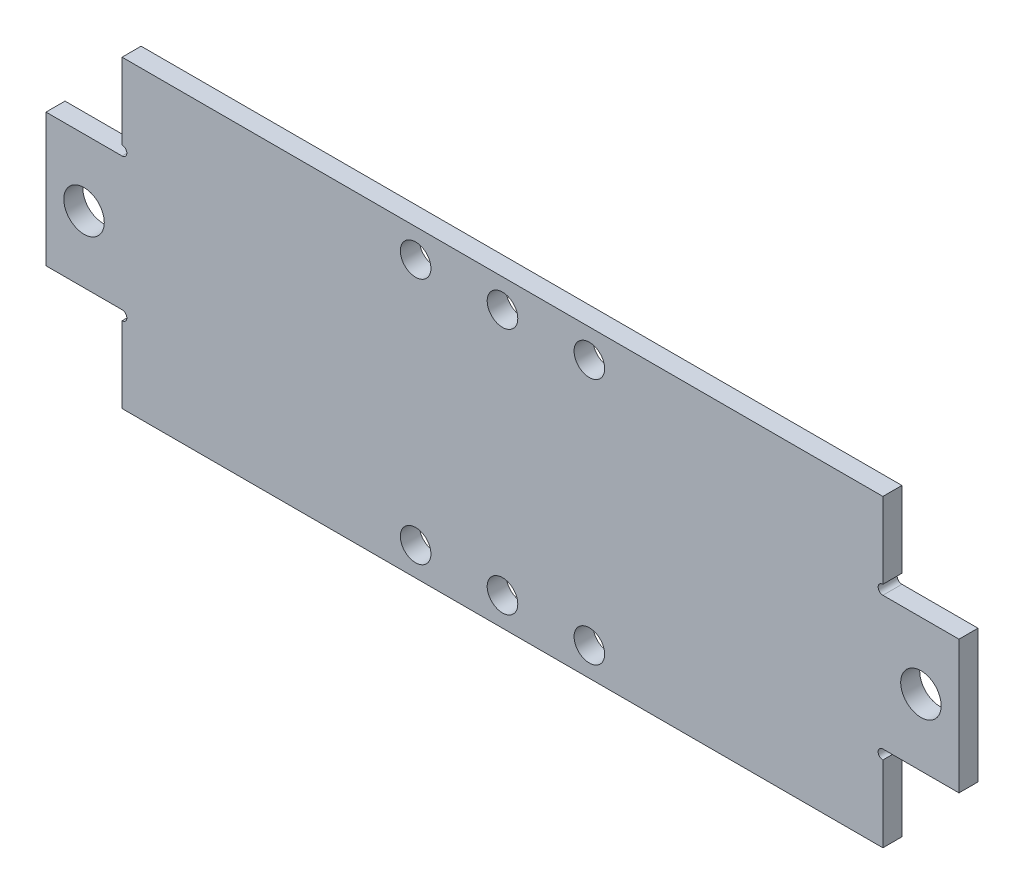
ISO-10303-21;
HEADER;
FILE_DESCRIPTION(('STEP AP214'),'2;1');
FILE_NAME('part.step','',(''),(''),'','','');
FILE_SCHEMA(('AUTOMOTIVE_DESIGN { 1 0 10303 214 1 1 1 1 }'));
ENDSEC;
DATA;
#1=APPLICATION_CONTEXT('core data for automotive mechanical design processes');
#2=APPLICATION_PROTOCOL_DEFINITION('international standard','automotive_design',2000,#1);
#3=PRODUCT_CONTEXT('',#1,'mechanical');
#4=PRODUCT('Part','Part','',(#3));
#5=PRODUCT_RELATED_PRODUCT_CATEGORY('part','',(#4));
#6=PRODUCT_DEFINITION_FORMATION('','',#4);
#7=PRODUCT_DEFINITION_CONTEXT('part definition',#1,'design');
#8=PRODUCT_DEFINITION('design','',#6,#7);
#9=PRODUCT_DEFINITION_SHAPE('','',#8);
#10=(LENGTH_UNIT() NAMED_UNIT(*) SI_UNIT(.MILLI.,.METRE.));
#11=(NAMED_UNIT(*) PLANE_ANGLE_UNIT() SI_UNIT($,.RADIAN.));
#12=(NAMED_UNIT(*) SI_UNIT($,.STERADIAN.) SOLID_ANGLE_UNIT());
#13=UNCERTAINTY_MEASURE_WITH_UNIT(LENGTH_MEASURE(1.E-05),#10,'distance_accuracy_value','');
#14=(GEOMETRIC_REPRESENTATION_CONTEXT(3) GLOBAL_UNCERTAINTY_ASSIGNED_CONTEXT((#13)) GLOBAL_UNIT_ASSIGNED_CONTEXT((#10,
#11,#12)) REPRESENTATION_CONTEXT('',''));
#15=CARTESIAN_POINT('',(0.,0.,0.));
#16=DIRECTION('',(0.,0.,1.));
#17=DIRECTION('',(1.,0.,0.));
#18=AXIS2_PLACEMENT_3D('',#15,#16,#17);
#19=CARTESIAN_POINT('',(0.,0.,3.175));
#20=DIRECTION('',(0.,0.,-1.));
#21=DIRECTION('',(-1.,0.,0.));
#22=AXIS2_PLACEMENT_3D('',#19,#20,#21);
#23=PLANE('',#22);
#24=CARTESIAN_POINT('',(78.,46.0375,3.175));
#25=DIRECTION('',(0.,0.,1.));
#26=DIRECTION('',(1.,0.,0.));
#27=AXIS2_PLACEMENT_3D('',#24,#25,#26);
#28=CIRCLE('',#27,2.55270000000001);
#29=CARTESIAN_POINT('',(80.5527,46.0375,3.175));
#30=VERTEX_POINT('',#29);
#31=EDGE_CURVE('E393',#30,#30,#28,.T.);
#32=ORIENTED_EDGE('',*,*,#31,.F.);
#33=EDGE_LOOP('',(#32));
#34=FACE_BOUND('',#33,.T.);
#35=DIRECTION('',(-1.,0.,0.));
#36=VECTOR('',#35,1.);
#37=CARTESIAN_POINT('',(127.,36.5125,3.175));
#38=LINE('',#37,#36);
#39=CARTESIAN_POINT('',(139.7,36.5125,3.175));
#40=VERTEX_POINT('',#39);
#41=CARTESIAN_POINT('',(127.,36.5125,3.175));
#42=VERTEX_POINT('',#41);
#43=EDGE_CURVE('E174',#40,#42,#38,.T.);
#44=ORIENTED_EDGE('',*,*,#43,.T.);
#45=CARTESIAN_POINT('',(127.,37.30625,3.175));
#46=DIRECTION('',(0.,0.,1.));
#47=DIRECTION('',(1.,0.,0.));
#48=AXIS2_PLACEMENT_3D('',#45,#46,#47);
#49=CIRCLE('',#48,0.793750000000021);
#50=CARTESIAN_POINT('',(127.,38.1,3.175));
#51=VERTEX_POINT('',#50);
#52=EDGE_CURVE('E162',#51,#42,#49,.T.);
#53=ORIENTED_EDGE('',*,*,#52,.F.);
#54=DIRECTION('',(0.,1.,0.));
#55=VECTOR('',#54,1.);
#56=CARTESIAN_POINT('',(127.,0.,3.175));
#57=LINE('',#56,#55);
#58=CARTESIAN_POINT('',(127.,50.8,3.175));
#59=VERTEX_POINT('',#58);
#60=EDGE_CURVE('E171',#51,#59,#57,.T.);
#61=ORIENTED_EDGE('',*,*,#60,.T.);
#62=DIRECTION('',(-1.,0.,0.));
#63=VECTOR('',#62,1.);
#64=CARTESIAN_POINT('',(0.,50.8,3.175));
#65=LINE('',#64,#63);
#66=CARTESIAN_POINT('',(0.,50.8,3.175));
#67=VERTEX_POINT('',#66);
#68=EDGE_CURVE('E54',#59,#67,#65,.T.);
#69=ORIENTED_EDGE('',*,*,#68,.T.);
#70=DIRECTION('',(0.,-1.,0.));
#71=VECTOR('',#70,1.);
#72=CARTESIAN_POINT('',(0.,0.,3.175));
#73=LINE('',#72,#71);
#74=CARTESIAN_POINT('',(0.,38.1,3.175));
#75=VERTEX_POINT('',#74);
#76=EDGE_CURVE('E184',#67,#75,#73,.T.);
#77=ORIENTED_EDGE('',*,*,#76,.T.);
#78=CARTESIAN_POINT('',(0.,37.30625,3.175));
#79=DIRECTION('',(0.,0.,1.));
#80=DIRECTION('',(1.,0.,0.));
#81=AXIS2_PLACEMENT_3D('',#78,#79,#80);
#82=CIRCLE('',#81,0.79375);
#83=CARTESIAN_POINT('',(0.,36.5125,3.175));
#84=VERTEX_POINT('',#83);
#85=EDGE_CURVE('E269',#84,#75,#82,.T.);
#86=ORIENTED_EDGE('',*,*,#85,.F.);
#87=DIRECTION('',(-1.,0.,0.));
#88=VECTOR('',#87,1.);
#89=CARTESIAN_POINT('',(0.,36.5125,3.175));
#90=LINE('',#89,#88);
#91=CARTESIAN_POINT('',(-12.7,36.5125,3.175));
#92=VERTEX_POINT('',#91);
#93=EDGE_CURVE('E210',#84,#92,#90,.T.);
#94=ORIENTED_EDGE('',*,*,#93,.T.);
#95=DIRECTION('',(0.,-1.,0.));
#96=VECTOR('',#95,1.);
#97=CARTESIAN_POINT('',(-12.7,36.5125,3.175));
#98=LINE('',#97,#96);
#99=CARTESIAN_POINT('',(-12.7,14.2875,3.175));
#100=VERTEX_POINT('',#99);
#101=EDGE_CURVE('E219',#92,#100,#98,.T.);
#102=ORIENTED_EDGE('',*,*,#101,.T.);
#103=DIRECTION('',(1.,0.,0.));
#104=VECTOR('',#103,1.);
#105=CARTESIAN_POINT('',(0.,14.2875,3.175));
#106=LINE('',#105,#104);
#107=CARTESIAN_POINT('',(0.,14.2875,3.175));
#108=VERTEX_POINT('',#107);
#109=EDGE_CURVE('E222',#100,#108,#106,.T.);
#110=ORIENTED_EDGE('',*,*,#109,.T.);
#111=CARTESIAN_POINT('',(0.,13.49375,3.175));
#112=DIRECTION('',(0.,0.,1.));
#113=DIRECTION('',(1.,0.,0.));
#114=AXIS2_PLACEMENT_3D('',#111,#112,#113);
#115=CIRCLE('',#114,0.79375);
#116=CARTESIAN_POINT('',(0.,12.7,3.175));
#117=VERTEX_POINT('',#116);
#118=EDGE_CURVE('E282',#117,#108,#115,.T.);
#119=ORIENTED_EDGE('',*,*,#118,.F.);
#120=CARTESIAN_POINT('',(0.,0.,3.175));
#121=VERTEX_POINT('',#120);
#122=EDGE_CURVE('E85',#117,#121,#73,.T.);
#123=ORIENTED_EDGE('',*,*,#122,.T.);
#124=DIRECTION('',(1.,0.,0.));
#125=VECTOR('',#124,1.);
#126=CARTESIAN_POINT('',(0.,0.,3.175));
#127=LINE('',#126,#125);
#128=CARTESIAN_POINT('',(127.,0.,3.175));
#129=VERTEX_POINT('',#128);
#130=EDGE_CURVE('E180',#121,#129,#127,.T.);
#131=ORIENTED_EDGE('',*,*,#130,.T.);
#132=CARTESIAN_POINT('',(127.,12.7,3.175));
#133=VERTEX_POINT('',#132);
#134=EDGE_CURVE('E179',#129,#133,#57,.T.);
#135=ORIENTED_EDGE('',*,*,#134,.T.);
#136=CARTESIAN_POINT('',(127.,13.49375,3.175));
#137=DIRECTION('',(0.,0.,1.));
#138=DIRECTION('',(1.,0.,0.));
#139=AXIS2_PLACEMENT_3D('',#136,#137,#138);
#140=CIRCLE('',#139,0.79375000000002);
#141=CARTESIAN_POINT('',(127.,14.2875,3.175));
#142=VERTEX_POINT('',#141);
#143=EDGE_CURVE('E167',#142,#133,#140,.T.);
#144=ORIENTED_EDGE('',*,*,#143,.F.);
#145=DIRECTION('',(1.,0.,0.));
#146=VECTOR('',#145,1.);
#147=CARTESIAN_POINT('',(127.,14.2875,3.175));
#148=LINE('',#147,#146);
#149=CARTESIAN_POINT('',(139.7,14.2875,3.175));
#150=VERTEX_POINT('',#149);
#151=EDGE_CURVE('E200',#142,#150,#148,.T.);
#152=ORIENTED_EDGE('',*,*,#151,.T.);
#153=DIRECTION('',(0.,1.,0.));
#154=VECTOR('',#153,1.);
#155=CARTESIAN_POINT('',(139.7,36.5125,3.175));
#156=LINE('',#155,#154);
#157=EDGE_CURVE('E203',#150,#40,#156,.T.);
#158=ORIENTED_EDGE('',*,*,#157,.T.);
#159=EDGE_LOOP('',(#44,#53,#61,#69,#77,#86,#94,#102,#110,#119,#123,#131,#135,#144,#152,#158));
#160=FACE_BOUND('',#159,.T.);
#161=CARTESIAN_POINT('',(133.35,25.4,3.175));
#162=DIRECTION('',(0.,0.,1.));
#163=DIRECTION('',(1.,0.,0.));
#164=AXIS2_PLACEMENT_3D('',#161,#162,#163);
#165=CIRCLE('',#164,3.3782);
#166=CARTESIAN_POINT('',(136.7282,25.4,3.175));
#167=VERTEX_POINT('',#166);
#168=EDGE_CURVE('E363',#167,#167,#165,.T.);
#169=ORIENTED_EDGE('',*,*,#168,.F.);
#170=EDGE_LOOP('',(#169));
#171=FACE_BOUND('',#170,.T.);
#172=CARTESIAN_POINT('',(-6.35,25.4,3.175));
#173=DIRECTION('',(0.,0.,1.));
#174=DIRECTION('',(1.,0.,0.));
#175=AXIS2_PLACEMENT_3D('',#172,#173,#174);
#176=CIRCLE('',#175,3.3782);
#177=CARTESIAN_POINT('',(-2.9718,25.4,3.175));
#178=VERTEX_POINT('',#177);
#179=EDGE_CURVE('E366',#178,#178,#176,.T.);
#180=ORIENTED_EDGE('',*,*,#179,.F.);
#181=EDGE_LOOP('',(#180));
#182=FACE_BOUND('',#181,.T.);
#183=CARTESIAN_POINT('',(49.,4.7625,3.175));
#184=DIRECTION('',(0.,0.,1.));
#185=DIRECTION('',(1.,0.,0.));
#186=AXIS2_PLACEMENT_3D('',#183,#184,#185);
#187=CIRCLE('',#186,2.5527);
#188=CARTESIAN_POINT('',(51.5527,4.7625,3.175));
#189=VERTEX_POINT('',#188);
#190=EDGE_CURVE('E372',#189,#189,#187,.T.);
#191=ORIENTED_EDGE('',*,*,#190,.F.);
#192=EDGE_LOOP('',(#191));
#193=FACE_BOUND('',#192,.T.);
#194=CARTESIAN_POINT('',(78.,4.7625,3.175));
#195=DIRECTION('',(0.,0.,1.));
#196=DIRECTION('',(1.,0.,0.));
#197=AXIS2_PLACEMENT_3D('',#194,#195,#196);
#198=CIRCLE('',#197,2.55270000000001);
#199=CARTESIAN_POINT('',(80.5527,4.7625,3.175));
#200=VERTEX_POINT('',#199);
#201=EDGE_CURVE('E378',#200,#200,#198,.T.);
#202=ORIENTED_EDGE('',*,*,#201,.F.);
#203=EDGE_LOOP('',(#202));
#204=FACE_BOUND('',#203,.T.);
#205=CARTESIAN_POINT('',(63.5,4.7625,3.175));
#206=DIRECTION('',(0.,0.,1.));
#207=DIRECTION('',(1.,0.,0.));
#208=AXIS2_PLACEMENT_3D('',#205,#206,#207);
#209=CIRCLE('',#208,2.55270000000001);
#210=CARTESIAN_POINT('',(66.0527,4.7625,3.175));
#211=VERTEX_POINT('',#210);
#212=EDGE_CURVE('E384',#211,#211,#209,.T.);
#213=ORIENTED_EDGE('',*,*,#212,.F.);
#214=EDGE_LOOP('',(#213));
#215=FACE_BOUND('',#214,.T.);
#216=CARTESIAN_POINT('',(49.,46.0375,3.175));
#217=DIRECTION('',(0.,0.,1.));
#218=DIRECTION('',(1.,0.,0.));
#219=AXIS2_PLACEMENT_3D('',#216,#217,#218);
#220=CIRCLE('',#219,2.5527);
#221=CARTESIAN_POINT('',(51.5527,46.0375,3.175));
#222=VERTEX_POINT('',#221);
#223=EDGE_CURVE('E390',#222,#222,#220,.T.);
#224=ORIENTED_EDGE('',*,*,#223,.F.);
#225=EDGE_LOOP('',(#224));
#226=FACE_BOUND('',#225,.T.);
#227=CARTESIAN_POINT('',(63.5,46.0375,3.175));
#228=DIRECTION('',(0.,0.,1.));
#229=DIRECTION('',(1.,0.,0.));
#230=AXIS2_PLACEMENT_3D('',#227,#228,#229);
#231=CIRCLE('',#230,2.55270000000001);
#232=CARTESIAN_POINT('',(66.0527,46.0375,3.175));
#233=VERTEX_POINT('',#232);
#234=EDGE_CURVE('E399',#233,#233,#231,.T.);
#235=ORIENTED_EDGE('',*,*,#234,.F.);
#236=EDGE_LOOP('',(#235));
#237=FACE_BOUND('',#236,.T.);
#238=ADVANCED_FACE('F35',(#34,#160,#171,#182,#193,#204,#215,#226,#237),#23,.F.);
#239=CARTESIAN_POINT('',(127.,0.,3.175));
#240=DIRECTION('',(-1.,0.,0.));
#241=DIRECTION('',(0.,0.,1.));
#242=AXIS2_PLACEMENT_3D('',#239,#240,#241);
#243=PLANE('',#242);
#244=ORIENTED_EDGE('',*,*,#60,.F.);
#245=DIRECTION('',(0.,0.,1.));
#246=VECTOR('',#245,1.);
#247=CARTESIAN_POINT('',(127.,38.1,-5.00000000001367E-05));
#248=LINE('',#247,#246);
#249=CARTESIAN_POINT('',(127.,38.1,0.));
#250=VERTEX_POINT('',#249);
#251=EDGE_CURVE('E159',#51,#250,#248,.F.);
#252=ORIENTED_EDGE('',*,*,#251,.T.);
#253=DIRECTION('',(0.,1.,0.));
#254=VECTOR('',#253,1.);
#255=CARTESIAN_POINT('',(127.,0.,0.));
#256=LINE('',#255,#254);
#257=CARTESIAN_POINT('',(127.,50.8,0.));
#258=VERTEX_POINT('',#257);
#259=EDGE_CURVE('E72',#250,#258,#256,.T.);
#260=ORIENTED_EDGE('',*,*,#259,.T.);
#261=DIRECTION('',(0.,0.,-1.));
#262=VECTOR('',#261,1.);
#263=CARTESIAN_POINT('',(127.,50.8,3.175));
#264=LINE('',#263,#262);
#265=EDGE_CURVE('E178',#59,#258,#264,.T.);
#266=ORIENTED_EDGE('',*,*,#265,.F.);
#267=EDGE_LOOP('',(#244,#252,#260,#266));
#268=FACE_BOUND('',#267,.T.);
#269=ADVANCED_FACE('F177',(#268),#243,.F.);
#270=CARTESIAN_POINT('',(0.,0.,3.175));
#271=DIRECTION('',(1.,0.,0.));
#272=DIRECTION('',(0.,0.,-1.));
#273=AXIS2_PLACEMENT_3D('',#270,#271,#272);
#274=PLANE('',#273);
#275=ORIENTED_EDGE('',*,*,#122,.F.);
#276=DIRECTION('',(0.,0.,1.));
#277=VECTOR('',#276,1.);
#278=CARTESIAN_POINT('',(0.,12.7,-5.00000000001367E-05));
#279=LINE('',#278,#277);
#280=CARTESIAN_POINT('',(0.,12.7,0.));
#281=VERTEX_POINT('',#280);
#282=EDGE_CURVE('E287',#117,#281,#279,.F.);
#283=ORIENTED_EDGE('',*,*,#282,.T.);
#284=DIRECTION('',(0.,-1.,0.));
#285=VECTOR('',#284,1.);
#286=CARTESIAN_POINT('',(0.,0.,0.));
#287=LINE('',#286,#285);
#288=CARTESIAN_POINT('',(0.,0.,0.));
#289=VERTEX_POINT('',#288);
#290=EDGE_CURVE('E255',#281,#289,#287,.T.);
#291=ORIENTED_EDGE('',*,*,#290,.T.);
#292=DIRECTION('',(0.,0.,-1.));
#293=VECTOR('',#292,1.);
#294=CARTESIAN_POINT('',(0.,0.,3.175));
#295=LINE('',#294,#293);
#296=EDGE_CURVE('E11',#121,#289,#295,.T.);
#297=ORIENTED_EDGE('',*,*,#296,.F.);
#298=EDGE_LOOP('',(#275,#283,#291,#297));
#299=FACE_BOUND('',#298,.T.);
#300=ADVANCED_FACE('F413',(#299),#274,.F.);
#301=CARTESIAN_POINT('',(0.,50.8,0.));
#302=VERTEX_POINT('',#301);
#303=CARTESIAN_POINT('',(0.,38.1,0.));
#304=VERTEX_POINT('',#303);
#305=EDGE_CURVE('E264',#302,#304,#287,.T.);
#306=ORIENTED_EDGE('',*,*,#305,.T.);
#307=DIRECTION('',(0.,0.,1.));
#308=VECTOR('',#307,1.);
#309=CARTESIAN_POINT('',(0.,38.1,-5.00000000001367E-05));
#310=LINE('',#309,#308);
#311=EDGE_CURVE('E204',#304,#75,#310,.T.);
#312=ORIENTED_EDGE('',*,*,#311,.T.);
#313=ORIENTED_EDGE('',*,*,#76,.F.);
#314=DIRECTION('',(0.,0.,-1.));
#315=VECTOR('',#314,1.);
#316=CARTESIAN_POINT('',(0.,50.8,3.175));
#317=LINE('',#316,#315);
#318=EDGE_CURVE('E329',#67,#302,#317,.T.);
#319=ORIENTED_EDGE('',*,*,#318,.T.);
#320=EDGE_LOOP('',(#306,#312,#313,#319));
#321=FACE_BOUND('',#320,.T.);
#322=ADVANCED_FACE('F37',(#321),#274,.F.);
#323=CARTESIAN_POINT('',(0.,0.,3.175));
#324=DIRECTION('',(0.,1.,0.));
#325=DIRECTION('',(0.,0.,1.));
#326=AXIS2_PLACEMENT_3D('',#323,#324,#325);
#327=PLANE('',#326);
#328=DIRECTION('',(1.,0.,0.));
#329=VECTOR('',#328,1.);
#330=CARTESIAN_POINT('',(0.,0.,0.));
#331=LINE('',#330,#329);
#332=CARTESIAN_POINT('',(127.,0.,0.));
#333=VERTEX_POINT('',#332);
#334=EDGE_CURVE('E323',#289,#333,#331,.T.);
#335=ORIENTED_EDGE('',*,*,#334,.T.);
#336=DIRECTION('',(0.,0.,-1.));
#337=VECTOR('',#336,1.);
#338=CARTESIAN_POINT('',(127.,0.,3.175));
#339=LINE('',#338,#337);
#340=EDGE_CURVE('E45',#129,#333,#339,.T.);
#341=ORIENTED_EDGE('',*,*,#340,.F.);
#342=ORIENTED_EDGE('',*,*,#130,.F.);
#343=ORIENTED_EDGE('',*,*,#296,.T.);
#344=EDGE_LOOP('',(#335,#341,#342,#343));
#345=FACE_BOUND('',#344,.T.);
#346=ADVANCED_FACE('F424',(#345),#327,.F.);
#347=CARTESIAN_POINT('',(127.,12.7,0.));
#348=VERTEX_POINT('',#347);
#349=EDGE_CURVE('E198',#333,#348,#256,.T.);
#350=ORIENTED_EDGE('',*,*,#349,.T.);
#351=DIRECTION('',(0.,0.,1.));
#352=VECTOR('',#351,1.);
#353=CARTESIAN_POINT('',(127.,12.7,-5.00000000001367E-05));
#354=LINE('',#353,#352);
#355=EDGE_CURVE('E290',#348,#133,#354,.T.);
#356=ORIENTED_EDGE('',*,*,#355,.T.);
#357=ORIENTED_EDGE('',*,*,#134,.F.);
#358=ORIENTED_EDGE('',*,*,#340,.T.);
#359=EDGE_LOOP('',(#350,#356,#357,#358));
#360=FACE_BOUND('',#359,.T.);
#361=ADVANCED_FACE('F338',(#360),#243,.F.);
#362=CARTESIAN_POINT('',(0.,50.8,3.175));
#363=DIRECTION('',(0.,-1.,0.));
#364=DIRECTION('',(0.,0.,-1.));
#365=AXIS2_PLACEMENT_3D('',#362,#363,#364);
#366=PLANE('',#365);
#367=DIRECTION('',(-1.,0.,0.));
#368=VECTOR('',#367,1.);
#369=CARTESIAN_POINT('',(0.,50.8,0.));
#370=LINE('',#369,#368);
#371=EDGE_CURVE('E78',#258,#302,#370,.T.);
#372=ORIENTED_EDGE('',*,*,#371,.T.);
#373=ORIENTED_EDGE('',*,*,#318,.F.);
#374=ORIENTED_EDGE('',*,*,#68,.F.);
#375=ORIENTED_EDGE('',*,*,#265,.T.);
#376=EDGE_LOOP('',(#372,#373,#374,#375));
#377=FACE_BOUND('',#376,.T.);
#378=ADVANCED_FACE('F420',(#377),#366,.F.);
#379=CARTESIAN_POINT('',(0.,0.,0.));
#380=DIRECTION('',(0.,0.,-1.));
#381=DIRECTION('',(-1.,0.,0.));
#382=AXIS2_PLACEMENT_3D('',#379,#380,#381);
#383=PLANE('',#382);
#384=CARTESIAN_POINT('',(63.5,46.0375,0.));
#385=DIRECTION('',(0.,0.,-1.));
#386=DIRECTION('',(-1.,0.,0.));
#387=AXIS2_PLACEMENT_3D('',#384,#385,#386);
#388=CIRCLE('',#387,2.5527);
#389=CARTESIAN_POINT('',(60.9473,46.0375,0.));
#390=VERTEX_POINT('',#389);
#391=EDGE_CURVE('E396',#390,#390,#388,.T.);
#392=ORIENTED_EDGE('',*,*,#391,.F.);
#393=EDGE_LOOP('',(#392));
#394=FACE_BOUND('',#393,.T.);
#395=CARTESIAN_POINT('',(78.,46.0375,0.));
#396=DIRECTION('',(0.,0.,-1.));
#397=DIRECTION('',(-1.,0.,0.));
#398=AXIS2_PLACEMENT_3D('',#395,#396,#397);
#399=CIRCLE('',#398,2.5527);
#400=CARTESIAN_POINT('',(75.4473,46.0375,0.));
#401=VERTEX_POINT('',#400);
#402=EDGE_CURVE('E39',#401,#401,#399,.T.);
#403=ORIENTED_EDGE('',*,*,#402,.F.);
#404=EDGE_LOOP('',(#403));
#405=FACE_BOUND('',#404,.T.);
#406=CARTESIAN_POINT('',(49.,46.0375,0.));
#407=DIRECTION('',(0.,0.,-1.));
#408=DIRECTION('',(-1.,0.,0.));
#409=AXIS2_PLACEMENT_3D('',#406,#407,#408);
#410=CIRCLE('',#409,2.5527);
#411=CARTESIAN_POINT('',(46.4473,46.0375,0.));
#412=VERTEX_POINT('',#411);
#413=EDGE_CURVE('E387',#412,#412,#410,.T.);
#414=ORIENTED_EDGE('',*,*,#413,.F.);
#415=EDGE_LOOP('',(#414));
#416=FACE_BOUND('',#415,.T.);
#417=CARTESIAN_POINT('',(63.5,4.7625,0.));
#418=DIRECTION('',(0.,0.,-1.));
#419=DIRECTION('',(-1.,0.,0.));
#420=AXIS2_PLACEMENT_3D('',#417,#418,#419);
#421=CIRCLE('',#420,2.5527);
#422=CARTESIAN_POINT('',(60.9473,4.7625,0.));
#423=VERTEX_POINT('',#422);
#424=EDGE_CURVE('E381',#423,#423,#421,.T.);
#425=ORIENTED_EDGE('',*,*,#424,.F.);
#426=EDGE_LOOP('',(#425));
#427=FACE_BOUND('',#426,.T.);
#428=CARTESIAN_POINT('',(78.,4.7625,0.));
#429=DIRECTION('',(0.,0.,-1.));
#430=DIRECTION('',(-1.,0.,0.));
#431=AXIS2_PLACEMENT_3D('',#428,#429,#430);
#432=CIRCLE('',#431,2.5527);
#433=CARTESIAN_POINT('',(75.4473,4.7625,0.));
#434=VERTEX_POINT('',#433);
#435=EDGE_CURVE('E375',#434,#434,#432,.T.);
#436=ORIENTED_EDGE('',*,*,#435,.F.);
#437=EDGE_LOOP('',(#436));
#438=FACE_BOUND('',#437,.T.);
#439=CARTESIAN_POINT('',(49.,4.7625,0.));
#440=DIRECTION('',(0.,0.,-1.));
#441=DIRECTION('',(-1.,0.,0.));
#442=AXIS2_PLACEMENT_3D('',#439,#440,#441);
#443=CIRCLE('',#442,2.5527);
#444=CARTESIAN_POINT('',(46.4473,4.7625,0.));
#445=VERTEX_POINT('',#444);
#446=EDGE_CURVE('E369',#445,#445,#443,.T.);
#447=ORIENTED_EDGE('',*,*,#446,.F.);
#448=EDGE_LOOP('',(#447));
#449=FACE_BOUND('',#448,.T.);
#450=CARTESIAN_POINT('',(-6.35,25.4,0.));
#451=DIRECTION('',(0.,0.,-1.));
#452=DIRECTION('',(-1.,0.,0.));
#453=AXIS2_PLACEMENT_3D('',#450,#451,#452);
#454=CIRCLE('',#453,3.3782);
#455=CARTESIAN_POINT('',(-9.7282,25.4,0.));
#456=VERTEX_POINT('',#455);
#457=EDGE_CURVE('E190',#456,#456,#454,.T.);
#458=ORIENTED_EDGE('',*,*,#457,.F.);
#459=EDGE_LOOP('',(#458));
#460=FACE_BOUND('',#459,.T.);
#461=CARTESIAN_POINT('',(133.35,25.4,0.));
#462=DIRECTION('',(0.,0.,-1.));
#463=DIRECTION('',(-1.,0.,0.));
#464=AXIS2_PLACEMENT_3D('',#461,#462,#463);
#465=CIRCLE('',#464,3.3782);
#466=CARTESIAN_POINT('',(129.9718,25.4,0.));
#467=VERTEX_POINT('',#466);
#468=EDGE_CURVE('E175',#467,#467,#465,.T.);
#469=ORIENTED_EDGE('',*,*,#468,.F.);
#470=EDGE_LOOP('',(#469));
#471=FACE_BOUND('',#470,.T.);
#472=CARTESIAN_POINT('',(127.,37.30625,0.));
#473=DIRECTION('',(0.,0.,-1.));
#474=DIRECTION('',(-1.,0.,0.));
#475=AXIS2_PLACEMENT_3D('',#472,#473,#474);
#476=CIRCLE('',#475,0.793750000000021);
#477=CARTESIAN_POINT('',(127.,36.5125,0.));
#478=VERTEX_POINT('',#477);
#479=EDGE_CURVE('E165',#478,#250,#476,.T.);
#480=ORIENTED_EDGE('',*,*,#479,.F.);
#481=DIRECTION('',(-1.,0.,0.));
#482=VECTOR('',#481,1.);
#483=CARTESIAN_POINT('',(127.,36.5125,0.));
#484=LINE('',#483,#482);
#485=CARTESIAN_POINT('',(139.7,36.5125,0.));
#486=VERTEX_POINT('',#485);
#487=EDGE_CURVE('E313',#486,#478,#484,.T.);
#488=ORIENTED_EDGE('',*,*,#487,.F.);
#489=DIRECTION('',(0.,1.,0.));
#490=VECTOR('',#489,1.);
#491=CARTESIAN_POINT('',(139.7,36.5125,0.));
#492=LINE('',#491,#490);
#493=CARTESIAN_POINT('',(139.7,14.2875,0.));
#494=VERTEX_POINT('',#493);
#495=EDGE_CURVE('E306',#494,#486,#492,.T.);
#496=ORIENTED_EDGE('',*,*,#495,.F.);
#497=DIRECTION('',(1.,0.,0.));
#498=VECTOR('',#497,1.);
#499=CARTESIAN_POINT('',(127.,14.2875,0.));
#500=LINE('',#499,#498);
#501=CARTESIAN_POINT('',(127.,14.2875,0.));
#502=VERTEX_POINT('',#501);
#503=EDGE_CURVE('E212',#502,#494,#500,.T.);
#504=ORIENTED_EDGE('',*,*,#503,.F.);
#505=CARTESIAN_POINT('',(127.,13.49375,0.));
#506=DIRECTION('',(0.,0.,-1.));
#507=DIRECTION('',(-1.,0.,0.));
#508=AXIS2_PLACEMENT_3D('',#505,#506,#507);
#509=CIRCLE('',#508,0.79375000000002);
#510=EDGE_CURVE('E343',#348,#502,#509,.T.);
#511=ORIENTED_EDGE('',*,*,#510,.F.);
#512=ORIENTED_EDGE('',*,*,#349,.F.);
#513=ORIENTED_EDGE('',*,*,#334,.F.);
#514=ORIENTED_EDGE('',*,*,#290,.F.);
#515=CARTESIAN_POINT('',(0.,13.49375,0.));
#516=DIRECTION('',(0.,0.,-1.));
#517=DIRECTION('',(-1.,0.,0.));
#518=AXIS2_PLACEMENT_3D('',#515,#516,#517);
#519=CIRCLE('',#518,0.79375);
#520=CARTESIAN_POINT('',(0.,14.2875,0.));
#521=VERTEX_POINT('',#520);
#522=EDGE_CURVE('E280',#521,#281,#519,.T.);
#523=ORIENTED_EDGE('',*,*,#522,.F.);
#524=DIRECTION('',(1.,0.,0.));
#525=VECTOR('',#524,1.);
#526=CARTESIAN_POINT('',(0.,14.2875,0.));
#527=LINE('',#526,#525);
#528=CARTESIAN_POINT('',(-12.7,14.2875,0.));
#529=VERTEX_POINT('',#528);
#530=EDGE_CURVE('E237',#529,#521,#527,.T.);
#531=ORIENTED_EDGE('',*,*,#530,.F.);
#532=DIRECTION('',(0.,-1.,0.));
#533=VECTOR('',#532,1.);
#534=CARTESIAN_POINT('',(-12.7,36.5125,0.));
#535=LINE('',#534,#533);
#536=CARTESIAN_POINT('',(-12.7,36.5125,0.));
#537=VERTEX_POINT('',#536);
#538=EDGE_CURVE('E223',#537,#529,#535,.T.);
#539=ORIENTED_EDGE('',*,*,#538,.F.);
#540=DIRECTION('',(-1.,0.,0.));
#541=VECTOR('',#540,1.);
#542=CARTESIAN_POINT('',(0.,36.5125,0.));
#543=LINE('',#542,#541);
#544=CARTESIAN_POINT('',(0.,36.5125,0.));
#545=VERTEX_POINT('',#544);
#546=EDGE_CURVE('E245',#545,#537,#543,.T.);
#547=ORIENTED_EDGE('',*,*,#546,.F.);
#548=CARTESIAN_POINT('',(0.,37.30625,0.));
#549=DIRECTION('',(0.,0.,-1.));
#550=DIRECTION('',(-1.,0.,0.));
#551=AXIS2_PLACEMENT_3D('',#548,#549,#550);
#552=CIRCLE('',#551,0.79375);
#553=EDGE_CURVE('E299',#304,#545,#552,.T.);
#554=ORIENTED_EDGE('',*,*,#553,.F.);
#555=ORIENTED_EDGE('',*,*,#305,.F.);
#556=ORIENTED_EDGE('',*,*,#371,.F.);
#557=ORIENTED_EDGE('',*,*,#259,.F.);
#558=EDGE_LOOP('',(#480,#488,#496,#504,#511,#512,#513,#514,#523,#531,#539,#547,#554,#555,#556,#557));
#559=FACE_BOUND('',#558,.T.);
#560=ADVANCED_FACE('F285',(#394,#405,#416,#427,#438,#449,#460,#471,#559),#383,.T.);
#561=CARTESIAN_POINT('',(0.,36.5125,-25.5976683508479));
#562=DIRECTION('',(0.,1.,0.));
#563=DIRECTION('',(0.,0.,1.));
#564=AXIS2_PLACEMENT_3D('',#561,#562,#563);
#565=PLANE('',#564);
#566=DIRECTION('',(0.,0.,1.));
#567=VECTOR('',#566,1.);
#568=CARTESIAN_POINT('',(0.,36.5125,-25.5976683508479));
#569=LINE('',#568,#567);
#570=EDGE_CURVE('E236',#545,#84,#569,.T.);
#571=ORIENTED_EDGE('',*,*,#570,.F.);
#572=ORIENTED_EDGE('',*,*,#546,.T.);
#573=DIRECTION('',(0.,0.,1.));
#574=VECTOR('',#573,1.);
#575=CARTESIAN_POINT('',(-12.7,36.5125,-25.5976683508479));
#576=LINE('',#575,#574);
#577=EDGE_CURVE('E227',#537,#92,#576,.T.);
#578=ORIENTED_EDGE('',*,*,#577,.T.);
#579=ORIENTED_EDGE('',*,*,#93,.F.);
#580=EDGE_LOOP('',(#571,#572,#578,#579));
#581=FACE_BOUND('',#580,.T.);
#582=ADVANCED_FACE('F270',(#581),#565,.T.);
#583=CARTESIAN_POINT('',(-12.7,36.5125,-25.5976683508479));
#584=DIRECTION('',(-1.,0.,0.));
#585=DIRECTION('',(0.,-1.,0.));
#586=AXIS2_PLACEMENT_3D('',#583,#584,#585);
#587=PLANE('',#586);
#588=ORIENTED_EDGE('',*,*,#577,.F.);
#589=ORIENTED_EDGE('',*,*,#538,.T.);
#590=DIRECTION('',(0.,0.,1.));
#591=VECTOR('',#590,1.);
#592=CARTESIAN_POINT('',(-12.7,14.2875,-25.5976683508479));
#593=LINE('',#592,#591);
#594=EDGE_CURVE('E226',#529,#100,#593,.T.);
#595=ORIENTED_EDGE('',*,*,#594,.T.);
#596=ORIENTED_EDGE('',*,*,#101,.F.);
#597=EDGE_LOOP('',(#588,#589,#595,#596));
#598=FACE_BOUND('',#597,.T.);
#599=ADVANCED_FACE('F273',(#598),#587,.T.);
#600=CARTESIAN_POINT('',(0.,14.2875,-25.5976683508479));
#601=DIRECTION('',(0.,-1.,0.));
#602=DIRECTION('',(0.,0.,-1.));
#603=AXIS2_PLACEMENT_3D('',#600,#601,#602);
#604=PLANE('',#603);
#605=ORIENTED_EDGE('',*,*,#594,.F.);
#606=ORIENTED_EDGE('',*,*,#530,.T.);
#607=DIRECTION('',(0.,0.,1.));
#608=VECTOR('',#607,1.);
#609=CARTESIAN_POINT('',(0.,14.2875,-25.5976683508479));
#610=LINE('',#609,#608);
#611=EDGE_CURVE('E232',#521,#108,#610,.T.);
#612=ORIENTED_EDGE('',*,*,#611,.T.);
#613=ORIENTED_EDGE('',*,*,#109,.F.);
#614=EDGE_LOOP('',(#605,#606,#612,#613));
#615=FACE_BOUND('',#614,.T.);
#616=ADVANCED_FACE('F276',(#615),#604,.T.);
#617=CARTESIAN_POINT('',(127.,14.2875,-25.5976683508479));
#618=DIRECTION('',(0.,-1.,0.));
#619=DIRECTION('',(1.,0.,0.));
#620=AXIS2_PLACEMENT_3D('',#617,#618,#619);
#621=PLANE('',#620);
#622=DIRECTION('',(0.,0.,1.));
#623=VECTOR('',#622,1.);
#624=CARTESIAN_POINT('',(127.,14.2875,-25.5976683508479));
#625=LINE('',#624,#623);
#626=EDGE_CURVE('E207',#502,#142,#625,.T.);
#627=ORIENTED_EDGE('',*,*,#626,.F.);
#628=ORIENTED_EDGE('',*,*,#503,.T.);
#629=DIRECTION('',(0.,0.,1.));
#630=VECTOR('',#629,1.);
#631=CARTESIAN_POINT('',(139.7,14.2875,-25.5976683508479));
#632=LINE('',#631,#630);
#633=EDGE_CURVE('E217',#494,#150,#632,.T.);
#634=ORIENTED_EDGE('',*,*,#633,.T.);
#635=ORIENTED_EDGE('',*,*,#151,.F.);
#636=EDGE_LOOP('',(#627,#628,#634,#635));
#637=FACE_BOUND('',#636,.T.);
#638=ADVANCED_FACE('F462',(#637),#621,.T.);
#639=CARTESIAN_POINT('',(139.7,36.5125,-25.5976683508479));
#640=DIRECTION('',(1.,0.,0.));
#641=DIRECTION('',(0.,0.,-1.));
#642=AXIS2_PLACEMENT_3D('',#639,#640,#641);
#643=PLANE('',#642);
#644=ORIENTED_EDGE('',*,*,#633,.F.);
#645=ORIENTED_EDGE('',*,*,#495,.T.);
#646=DIRECTION('',(0.,0.,1.));
#647=VECTOR('',#646,1.);
#648=CARTESIAN_POINT('',(139.7,36.5125,-25.5976683508479));
#649=LINE('',#648,#647);
#650=EDGE_CURVE('E309',#486,#40,#649,.T.);
#651=ORIENTED_EDGE('',*,*,#650,.T.);
#652=ORIENTED_EDGE('',*,*,#157,.F.);
#653=EDGE_LOOP('',(#644,#645,#651,#652));
#654=FACE_BOUND('',#653,.T.);
#655=ADVANCED_FACE('F471',(#654),#643,.T.);
#656=CARTESIAN_POINT('',(127.,36.5125,-25.5976683508479));
#657=DIRECTION('',(0.,1.,0.));
#658=DIRECTION('',(-1.,0.,0.));
#659=AXIS2_PLACEMENT_3D('',#656,#657,#658);
#660=PLANE('',#659);
#661=ORIENTED_EDGE('',*,*,#650,.F.);
#662=ORIENTED_EDGE('',*,*,#487,.T.);
#663=DIRECTION('',(0.,0.,1.));
#664=VECTOR('',#663,1.);
#665=CARTESIAN_POINT('',(127.,36.5125,-25.5976683508479));
#666=LINE('',#665,#664);
#667=EDGE_CURVE('E211',#478,#42,#666,.T.);
#668=ORIENTED_EDGE('',*,*,#667,.T.);
#669=ORIENTED_EDGE('',*,*,#43,.F.);
#670=EDGE_LOOP('',(#661,#662,#668,#669));
#671=FACE_BOUND('',#670,.T.);
#672=ADVANCED_FACE('F479',(#671),#660,.T.);
#673=CARTESIAN_POINT('',(0.,37.30625,-5.00000000001367E-05));
#674=DIRECTION('',(0.,0.,1.));
#675=DIRECTION('',(1.,0.,0.));
#676=AXIS2_PLACEMENT_3D('',#673,#674,#675);
#677=CYLINDRICAL_SURFACE('',#676,0.79375);
#678=ORIENTED_EDGE('',*,*,#553,.T.);
#679=ORIENTED_EDGE('',*,*,#570,.T.);
#680=ORIENTED_EDGE('',*,*,#85,.T.);
#681=ORIENTED_EDGE('',*,*,#311,.F.);
#682=EDGE_LOOP('',(#678,#679,#680,#681));
#683=FACE_BOUND('',#682,.T.);
#684=ADVANCED_FACE('F484',(#683),#677,.F.);
#685=CARTESIAN_POINT('',(0.,13.49375,-5.00000000001367E-05));
#686=DIRECTION('',(0.,0.,1.));
#687=DIRECTION('',(1.,0.,0.));
#688=AXIS2_PLACEMENT_3D('',#685,#686,#687);
#689=CYLINDRICAL_SURFACE('',#688,0.79375);
#690=ORIENTED_EDGE('',*,*,#118,.T.);
#691=ORIENTED_EDGE('',*,*,#611,.F.);
#692=ORIENTED_EDGE('',*,*,#522,.T.);
#693=ORIENTED_EDGE('',*,*,#282,.F.);
#694=EDGE_LOOP('',(#690,#691,#692,#693));
#695=FACE_BOUND('',#694,.T.);
#696=ADVANCED_FACE('F279',(#695),#689,.F.);
#697=CARTESIAN_POINT('',(127.,13.49375,-5.00000000001367E-05));
#698=DIRECTION('',(0.,0.,1.));
#699=DIRECTION('',(1.,0.,0.));
#700=AXIS2_PLACEMENT_3D('',#697,#698,#699);
#701=CYLINDRICAL_SURFACE('',#700,0.79375000000002);
#702=ORIENTED_EDGE('',*,*,#510,.T.);
#703=ORIENTED_EDGE('',*,*,#626,.T.);
#704=ORIENTED_EDGE('',*,*,#143,.T.);
#705=ORIENTED_EDGE('',*,*,#355,.F.);
#706=EDGE_LOOP('',(#702,#703,#704,#705));
#707=FACE_BOUND('',#706,.T.);
#708=ADVANCED_FACE('F503',(#707),#701,.F.);
#709=CARTESIAN_POINT('',(127.,37.30625,-5.00000000001367E-05));
#710=DIRECTION('',(0.,0.,1.));
#711=DIRECTION('',(1.,0.,0.));
#712=AXIS2_PLACEMENT_3D('',#709,#710,#711);
#713=CYLINDRICAL_SURFACE('',#712,0.793750000000021);
#714=ORIENTED_EDGE('',*,*,#52,.T.);
#715=ORIENTED_EDGE('',*,*,#667,.F.);
#716=ORIENTED_EDGE('',*,*,#479,.T.);
#717=ORIENTED_EDGE('',*,*,#251,.F.);
#718=EDGE_LOOP('',(#714,#715,#716,#717));
#719=FACE_BOUND('',#718,.T.);
#720=ADVANCED_FACE('F161',(#719),#713,.F.);
#721=CARTESIAN_POINT('',(133.35,25.4,3.175));
#722=DIRECTION('',(0.,0.,1.));
#723=DIRECTION('',(1.,0.,0.));
#724=AXIS2_PLACEMENT_3D('',#721,#722,#723);
#725=CYLINDRICAL_SURFACE('',#724,3.3782);
#726=ORIENTED_EDGE('',*,*,#468,.T.);
#727=EDGE_LOOP('',(#726));
#728=FACE_BOUND('',#727,.T.);
#729=ORIENTED_EDGE('',*,*,#168,.T.);
#730=EDGE_LOOP('',(#729));
#731=FACE_BOUND('',#730,.T.);
#732=ADVANCED_FACE('F520',(#728,#731),#725,.F.);
#733=CARTESIAN_POINT('',(-6.35,25.4,3.175));
#734=DIRECTION('',(0.,0.,1.));
#735=DIRECTION('',(1.,0.,0.));
#736=AXIS2_PLACEMENT_3D('',#733,#734,#735);
#737=CYLINDRICAL_SURFACE('',#736,3.3782);
#738=ORIENTED_EDGE('',*,*,#457,.T.);
#739=EDGE_LOOP('',(#738));
#740=FACE_BOUND('',#739,.T.);
#741=ORIENTED_EDGE('',*,*,#179,.T.);
#742=EDGE_LOOP('',(#741));
#743=FACE_BOUND('',#742,.T.);
#744=ADVANCED_FACE('F529',(#740,#743),#737,.F.);
#745=CARTESIAN_POINT('',(49.,4.7625,3.175));
#746=DIRECTION('',(0.,0.,1.));
#747=DIRECTION('',(1.,0.,0.));
#748=AXIS2_PLACEMENT_3D('',#745,#746,#747);
#749=CYLINDRICAL_SURFACE('',#748,2.5527);
#750=ORIENTED_EDGE('',*,*,#446,.T.);
#751=EDGE_LOOP('',(#750));
#752=FACE_BOUND('',#751,.T.);
#753=ORIENTED_EDGE('',*,*,#190,.T.);
#754=EDGE_LOOP('',(#753));
#755=FACE_BOUND('',#754,.T.);
#756=ADVANCED_FACE('F539',(#752,#755),#749,.F.);
#757=CARTESIAN_POINT('',(78.,4.7625,3.175));
#758=DIRECTION('',(0.,0.,1.));
#759=DIRECTION('',(1.,0.,0.));
#760=AXIS2_PLACEMENT_3D('',#757,#758,#759);
#761=CYLINDRICAL_SURFACE('',#760,2.5527);
#762=ORIENTED_EDGE('',*,*,#435,.T.);
#763=EDGE_LOOP('',(#762));
#764=FACE_BOUND('',#763,.T.);
#765=ORIENTED_EDGE('',*,*,#201,.T.);
#766=EDGE_LOOP('',(#765));
#767=FACE_BOUND('',#766,.T.);
#768=ADVANCED_FACE('F549',(#764,#767),#761,.F.);
#769=CARTESIAN_POINT('',(63.5,4.7625,3.175));
#770=DIRECTION('',(0.,0.,1.));
#771=DIRECTION('',(1.,0.,0.));
#772=AXIS2_PLACEMENT_3D('',#769,#770,#771);
#773=CYLINDRICAL_SURFACE('',#772,2.5527);
#774=ORIENTED_EDGE('',*,*,#424,.T.);
#775=EDGE_LOOP('',(#774));
#776=FACE_BOUND('',#775,.T.);
#777=ORIENTED_EDGE('',*,*,#212,.T.);
#778=EDGE_LOOP('',(#777));
#779=FACE_BOUND('',#778,.T.);
#780=ADVANCED_FACE('F559',(#776,#779),#773,.F.);
#781=CARTESIAN_POINT('',(49.,46.0375,3.175));
#782=DIRECTION('',(0.,0.,1.));
#783=DIRECTION('',(1.,0.,0.));
#784=AXIS2_PLACEMENT_3D('',#781,#782,#783);
#785=CYLINDRICAL_SURFACE('',#784,2.5527);
#786=ORIENTED_EDGE('',*,*,#413,.T.);
#787=EDGE_LOOP('',(#786));
#788=FACE_BOUND('',#787,.T.);
#789=ORIENTED_EDGE('',*,*,#223,.T.);
#790=EDGE_LOOP('',(#789));
#791=FACE_BOUND('',#790,.T.);
#792=ADVANCED_FACE('F568',(#788,#791),#785,.F.);
#793=CARTESIAN_POINT('',(78.,46.0375,3.175));
#794=DIRECTION('',(0.,0.,1.));
#795=DIRECTION('',(1.,0.,0.));
#796=AXIS2_PLACEMENT_3D('',#793,#794,#795);
#797=CYLINDRICAL_SURFACE('',#796,2.5527);
#798=ORIENTED_EDGE('',*,*,#402,.T.);
#799=EDGE_LOOP('',(#798));
#800=FACE_BOUND('',#799,.T.);
#801=ORIENTED_EDGE('',*,*,#31,.T.);
#802=EDGE_LOOP('',(#801));
#803=FACE_BOUND('',#802,.T.);
#804=ADVANCED_FACE('F591',(#800,#803),#797,.F.);
#805=CARTESIAN_POINT('',(63.5,46.0375,3.175));
#806=DIRECTION('',(0.,0.,1.));
#807=DIRECTION('',(1.,0.,0.));
#808=AXIS2_PLACEMENT_3D('',#805,#806,#807);
#809=CYLINDRICAL_SURFACE('',#808,2.5527);
#810=ORIENTED_EDGE('',*,*,#391,.T.);
#811=EDGE_LOOP('',(#810));
#812=FACE_BOUND('',#811,.T.);
#813=ORIENTED_EDGE('',*,*,#234,.T.);
#814=EDGE_LOOP('',(#813));
#815=FACE_BOUND('',#814,.T.);
#816=ADVANCED_FACE('F403',(#812,#815),#809,.F.);
#817=CLOSED_SHELL('',(#238,#269,#300,#322,#346,#361,#378,#560,#582,#599,#616,#638,#655,#672,
#684,#696,#708,#720,#732,#744,#756,#768,#780,#792,#804,#816));
#818=MANIFOLD_SOLID_BREP('B2',#817);
#819=ADVANCED_BREP_SHAPE_REPRESENTATION('',(#18,#818),#14);
#820=SHAPE_DEFINITION_REPRESENTATION(#9,#819);
ENDSEC;
END-ISO-10303-21;
